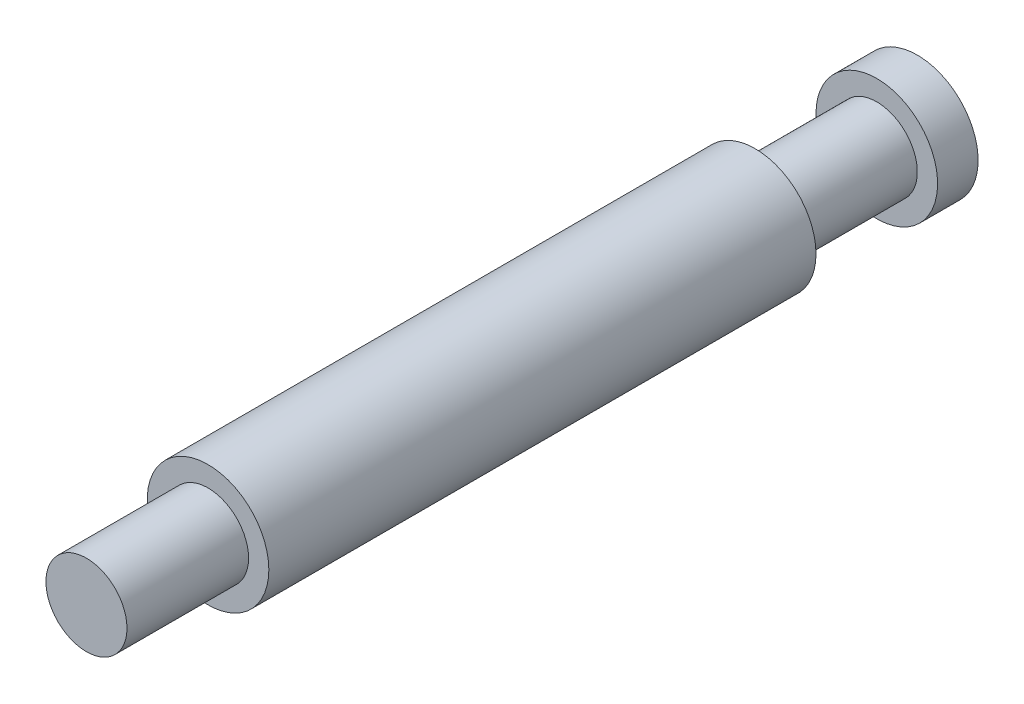
ISO-10303-21;
HEADER;
FILE_DESCRIPTION(('STEP AP214'),'2;1');
FILE_NAME('part.step','',(''),(''),'','','');
FILE_SCHEMA(('AUTOMOTIVE_DESIGN { 1 0 10303 214 1 1 1 1 }'));
ENDSEC;
DATA;
#1=APPLICATION_CONTEXT('core data for automotive mechanical design processes');
#2=APPLICATION_PROTOCOL_DEFINITION('international standard','automotive_design',2000,#1);
#3=PRODUCT_CONTEXT('',#1,'mechanical');
#4=PRODUCT('Part','Part','',(#3));
#5=PRODUCT_RELATED_PRODUCT_CATEGORY('part','',(#4));
#6=PRODUCT_DEFINITION_FORMATION('','',#4);
#7=PRODUCT_DEFINITION_CONTEXT('part definition',#1,'design');
#8=PRODUCT_DEFINITION('design','',#6,#7);
#9=PRODUCT_DEFINITION_SHAPE('','',#8);
#10=(LENGTH_UNIT() NAMED_UNIT(*) SI_UNIT(.MILLI.,.METRE.));
#11=(NAMED_UNIT(*) PLANE_ANGLE_UNIT() SI_UNIT($,.RADIAN.));
#12=(NAMED_UNIT(*) SI_UNIT($,.STERADIAN.) SOLID_ANGLE_UNIT());
#13=UNCERTAINTY_MEASURE_WITH_UNIT(LENGTH_MEASURE(1.E-05),#10,'distance_accuracy_value','');
#14=(GEOMETRIC_REPRESENTATION_CONTEXT(3) GLOBAL_UNCERTAINTY_ASSIGNED_CONTEXT((#13)) GLOBAL_UNIT_ASSIGNED_CONTEXT((#10,
#11,#12)) REPRESENTATION_CONTEXT('',''));
#15=CARTESIAN_POINT('',(0.,0.,0.));
#16=DIRECTION('',(0.,0.,1.));
#17=DIRECTION('',(1.,0.,0.));
#18=AXIS2_PLACEMENT_3D('',#15,#16,#17);
#19=CARTESIAN_POINT('',(0.,0.,13.5));
#20=DIRECTION('',(0.,0.,-1.));
#21=DIRECTION('',(-1.,0.,0.));
#22=AXIS2_PLACEMENT_3D('',#19,#20,#21);
#23=CYLINDRICAL_SURFACE('',#22,1.5);
#24=CARTESIAN_POINT('',(0.,0.,13.5));
#25=DIRECTION('',(0.,0.,1.));
#26=DIRECTION('',(1.,0.,0.));
#27=AXIS2_PLACEMENT_3D('',#24,#25,#26);
#28=CIRCLE('',#27,1.5);
#29=CARTESIAN_POINT('',(1.5,0.,13.5));
#30=VERTEX_POINT('',#29);
#31=EDGE_CURVE('E44',#30,#30,#28,.T.);
#32=ORIENTED_EDGE('',*,*,#31,.F.);
#33=EDGE_LOOP('',(#32));
#34=FACE_BOUND('',#33,.T.);
#35=CARTESIAN_POINT('',(0.,0.,0.));
#36=DIRECTION('',(0.,0.,1.));
#37=DIRECTION('',(1.,0.,0.));
#38=AXIS2_PLACEMENT_3D('',#35,#36,#37);
#39=CIRCLE('',#38,1.5);
#40=CARTESIAN_POINT('',(1.5,0.,0.));
#41=VERTEX_POINT('',#40);
#42=EDGE_CURVE('E35',#41,#41,#39,.T.);
#43=ORIENTED_EDGE('',*,*,#42,.T.);
#44=EDGE_LOOP('',(#43));
#45=FACE_BOUND('',#44,.T.);
#46=ADVANCED_FACE('F32',(#34,#45),#23,.T.);
#47=CARTESIAN_POINT('',(0.,0.,13.5));
#48=DIRECTION('',(0.,0.,1.));
#49=DIRECTION('',(1.,0.,0.));
#50=AXIS2_PLACEMENT_3D('',#47,#48,#49);
#51=PLANE('',#50);
#52=CARTESIAN_POINT('',(0.,0.,13.5));
#53=DIRECTION('',(0.,0.,1.));
#54=DIRECTION('',(1.,0.,0.));
#55=AXIS2_PLACEMENT_3D('',#52,#53,#54);
#56=CIRCLE('',#55,1.);
#57=CARTESIAN_POINT('',(1.,0.,13.5));
#58=VERTEX_POINT('',#57);
#59=EDGE_CURVE('E39',#58,#58,#56,.T.);
#60=ORIENTED_EDGE('',*,*,#59,.F.);
#61=EDGE_LOOP('',(#60));
#62=FACE_BOUND('',#61,.T.);
#63=ORIENTED_EDGE('',*,*,#31,.T.);
#64=EDGE_LOOP('',(#63));
#65=FACE_BOUND('',#64,.T.);
#66=ADVANCED_FACE('F62',(#62,#65),#51,.T.);
#67=CARTESIAN_POINT('',(0.,0.,0.));
#68=DIRECTION('',(0.,0.,1.));
#69=DIRECTION('',(1.,0.,0.));
#70=AXIS2_PLACEMENT_3D('',#67,#68,#69);
#71=PLANE('',#70);
#72=CARTESIAN_POINT('',(0.,0.,0.));
#73=DIRECTION('',(0.,0.,-1.));
#74=DIRECTION('',(-1.,0.,0.));
#75=AXIS2_PLACEMENT_3D('',#72,#73,#74);
#76=CIRCLE('',#75,1.);
#77=CARTESIAN_POINT('',(-1.,0.,0.));
#78=VERTEX_POINT('',#77);
#79=EDGE_CURVE('E10',#78,#78,#76,.T.);
#80=ORIENTED_EDGE('',*,*,#79,.F.);
#81=EDGE_LOOP('',(#80));
#82=FACE_BOUND('',#81,.T.);
#83=ORIENTED_EDGE('',*,*,#42,.F.);
#84=EDGE_LOOP('',(#83));
#85=FACE_BOUND('',#84,.T.);
#86=ADVANCED_FACE('F59',(#82,#85),#71,.F.);
#87=CARTESIAN_POINT('',(0.,0.,16.5));
#88=DIRECTION('',(0.,0.,-1.));
#89=DIRECTION('',(-1.,0.,0.));
#90=AXIS2_PLACEMENT_3D('',#87,#88,#89);
#91=CYLINDRICAL_SURFACE('',#90,1.);
#92=CARTESIAN_POINT('',(0.,0.,16.5));
#93=DIRECTION('',(0.,0.,1.));
#94=DIRECTION('',(1.,0.,0.));
#95=AXIS2_PLACEMENT_3D('',#92,#93,#94);
#96=CIRCLE('',#95,1.);
#97=CARTESIAN_POINT('',(1.,0.,16.5));
#98=VERTEX_POINT('',#97);
#99=EDGE_CURVE('E50',#98,#98,#96,.T.);
#100=ORIENTED_EDGE('',*,*,#99,.F.);
#101=EDGE_LOOP('',(#100));
#102=FACE_BOUND('',#101,.T.);
#103=ORIENTED_EDGE('',*,*,#59,.T.);
#104=EDGE_LOOP('',(#103));
#105=FACE_BOUND('',#104,.T.);
#106=ADVANCED_FACE('F61',(#102,#105),#91,.T.);
#107=CARTESIAN_POINT('',(0.,0.,16.5));
#108=DIRECTION('',(0.,0.,1.));
#109=DIRECTION('',(1.,0.,0.));
#110=AXIS2_PLACEMENT_3D('',#107,#108,#109);
#111=PLANE('',#110);
#112=ORIENTED_EDGE('',*,*,#99,.T.);
#113=EDGE_LOOP('',(#112));
#114=FACE_BOUND('',#113,.T.);
#115=ADVANCED_FACE('F68',(#114),#111,.T.);
#116=CARTESIAN_POINT('',(0.,0.,-3.));
#117=DIRECTION('',(0.,0.,1.));
#118=DIRECTION('',(1.,0.,0.));
#119=AXIS2_PLACEMENT_3D('',#116,#117,#118);
#120=CYLINDRICAL_SURFACE('',#119,1.);
#121=CARTESIAN_POINT('',(0.,0.,-3.));
#122=DIRECTION('',(0.,0.,-1.));
#123=DIRECTION('',(-1.,0.,0.));
#124=AXIS2_PLACEMENT_3D('',#121,#122,#123);
#125=CIRCLE('',#124,1.);
#126=CARTESIAN_POINT('',(-1.,0.,-3.));
#127=VERTEX_POINT('',#126);
#128=EDGE_CURVE('E48',#127,#127,#125,.T.);
#129=ORIENTED_EDGE('',*,*,#128,.F.);
#130=EDGE_LOOP('',(#129));
#131=FACE_BOUND('',#130,.T.);
#132=ORIENTED_EDGE('',*,*,#79,.T.);
#133=EDGE_LOOP('',(#132));
#134=FACE_BOUND('',#133,.T.);
#135=ADVANCED_FACE('F96',(#131,#134),#120,.T.);
#136=CARTESIAN_POINT('',(0.,0.,-4.));
#137=DIRECTION('',(0.,0.,1.));
#138=DIRECTION('',(1.,0.,0.));
#139=AXIS2_PLACEMENT_3D('',#136,#137,#138);
#140=CYLINDRICAL_SURFACE('',#139,1.5);
#141=CARTESIAN_POINT('',(0.,0.,-4.));
#142=DIRECTION('',(0.,0.,-1.));
#143=DIRECTION('',(-1.,0.,0.));
#144=AXIS2_PLACEMENT_3D('',#141,#142,#143);
#145=CIRCLE('',#144,1.5);
#146=CARTESIAN_POINT('',(-1.5,0.,-4.));
#147=VERTEX_POINT('',#146);
#148=EDGE_CURVE('E151',#147,#147,#145,.T.);
#149=ORIENTED_EDGE('',*,*,#148,.F.);
#150=EDGE_LOOP('',(#149));
#151=FACE_BOUND('',#150,.T.);
#152=CARTESIAN_POINT('',(0.,0.,-3.));
#153=DIRECTION('',(0.,0.,-1.));
#154=DIRECTION('',(-1.,0.,0.));
#155=AXIS2_PLACEMENT_3D('',#152,#153,#154);
#156=CIRCLE('',#155,1.5);
#157=CARTESIAN_POINT('',(-1.5,0.,-3.));
#158=VERTEX_POINT('',#157);
#159=EDGE_CURVE('E149',#158,#158,#156,.T.);
#160=ORIENTED_EDGE('',*,*,#159,.T.);
#161=EDGE_LOOP('',(#160));
#162=FACE_BOUND('',#161,.T.);
#163=ADVANCED_FACE('F110',(#151,#162),#140,.T.);
#164=CARTESIAN_POINT('',(0.,0.,-4.));
#165=DIRECTION('',(0.,0.,-1.));
#166=DIRECTION('',(-1.,0.,0.));
#167=AXIS2_PLACEMENT_3D('',#164,#165,#166);
#168=PLANE('',#167);
#169=ORIENTED_EDGE('',*,*,#148,.T.);
#170=EDGE_LOOP('',(#169));
#171=FACE_BOUND('',#170,.T.);
#172=ADVANCED_FACE('F120',(#171),#168,.T.);
#173=CARTESIAN_POINT('',(0.,0.,-3.));
#174=DIRECTION('',(0.,0.,-1.));
#175=DIRECTION('',(-1.,0.,0.));
#176=AXIS2_PLACEMENT_3D('',#173,#174,#175);
#177=PLANE('',#176);
#178=ORIENTED_EDGE('',*,*,#128,.T.);
#179=EDGE_LOOP('',(#178));
#180=FACE_BOUND('',#179,.T.);
#181=ORIENTED_EDGE('',*,*,#159,.F.);
#182=EDGE_LOOP('',(#181));
#183=FACE_BOUND('',#182,.T.);
#184=ADVANCED_FACE('F130',(#180,#183),#177,.F.);
#185=CLOSED_SHELL('',(#46,#66,#86,#106,#115,#135,#163,#172,#184));
#186=MANIFOLD_SOLID_BREP('B2',#185);
#187=ADVANCED_BREP_SHAPE_REPRESENTATION('',(#18,#186),#14);
#188=SHAPE_DEFINITION_REPRESENTATION(#9,#187);
ENDSEC;
END-ISO-10303-21;
